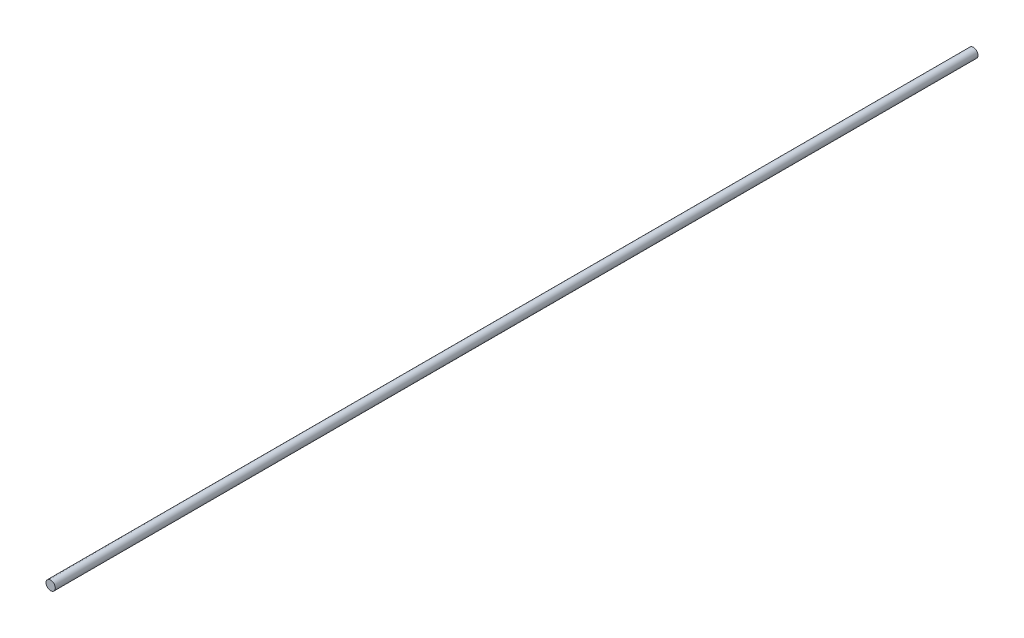
ISO-10303-21;
HEADER;
FILE_DESCRIPTION(('STEP AP214'),'2;1');
FILE_NAME('part.step','',(''),(''),'','','');
FILE_SCHEMA(('AUTOMOTIVE_DESIGN { 1 0 10303 214 1 1 1 1 }'));
ENDSEC;
DATA;
#1=APPLICATION_CONTEXT('core data for automotive mechanical design processes');
#2=APPLICATION_PROTOCOL_DEFINITION('international standard','automotive_design',2000,#1);
#3=PRODUCT_CONTEXT('',#1,'mechanical');
#4=PRODUCT('Part','Part','',(#3));
#5=PRODUCT_RELATED_PRODUCT_CATEGORY('part','',(#4));
#6=PRODUCT_DEFINITION_FORMATION('','',#4);
#7=PRODUCT_DEFINITION_CONTEXT('part definition',#1,'design');
#8=PRODUCT_DEFINITION('design','',#6,#7);
#9=PRODUCT_DEFINITION_SHAPE('','',#8);
#10=(LENGTH_UNIT() NAMED_UNIT(*) SI_UNIT(.MILLI.,.METRE.));
#11=(NAMED_UNIT(*) PLANE_ANGLE_UNIT() SI_UNIT($,.RADIAN.));
#12=(NAMED_UNIT(*) SI_UNIT($,.STERADIAN.) SOLID_ANGLE_UNIT());
#13=UNCERTAINTY_MEASURE_WITH_UNIT(LENGTH_MEASURE(1.E-05),#10,'distance_accuracy_value','');
#14=(GEOMETRIC_REPRESENTATION_CONTEXT(3) GLOBAL_UNCERTAINTY_ASSIGNED_CONTEXT((#13)) GLOBAL_UNIT_ASSIGNED_CONTEXT((#10,
#11,#12)) REPRESENTATION_CONTEXT('',''));
#15=CARTESIAN_POINT('',(0.,0.,0.));
#16=DIRECTION('',(0.,0.,1.));
#17=DIRECTION('',(1.,0.,0.));
#18=AXIS2_PLACEMENT_3D('',#15,#16,#17);
#19=CARTESIAN_POINT('',(0.,0.,315.468));
#20=DIRECTION('',(0.,0.,-1.));
#21=DIRECTION('',(-1.,0.,0.));
#22=AXIS2_PLACEMENT_3D('',#19,#20,#21);
#23=CYLINDRICAL_SURFACE('',#22,1.5875);
#24=CARTESIAN_POINT('',(0.,0.,315.468));
#25=DIRECTION('',(0.,0.,1.));
#26=DIRECTION('',(1.,0.,0.));
#27=AXIS2_PLACEMENT_3D('',#24,#25,#26);
#28=CIRCLE('',#27,1.5875);
#29=CARTESIAN_POINT('',(1.5875,0.,315.468));
#30=VERTEX_POINT('',#29);
#31=EDGE_CURVE('E10',#30,#30,#28,.T.);
#32=ORIENTED_EDGE('',*,*,#31,.F.);
#33=EDGE_LOOP('',(#32));
#34=FACE_BOUND('',#33,.T.);
#35=CARTESIAN_POINT('',(0.,0.,0.));
#36=DIRECTION('',(0.,0.,1.));
#37=DIRECTION('',(1.,0.,0.));
#38=AXIS2_PLACEMENT_3D('',#35,#36,#37);
#39=CIRCLE('',#38,1.5875);
#40=CARTESIAN_POINT('',(1.5875,0.,0.));
#41=VERTEX_POINT('',#40);
#42=EDGE_CURVE('E46',#41,#41,#39,.T.);
#43=ORIENTED_EDGE('',*,*,#42,.T.);
#44=EDGE_LOOP('',(#43));
#45=FACE_BOUND('',#44,.T.);
#46=ADVANCED_FACE('F43',(#34,#45),#23,.T.);
#47=CARTESIAN_POINT('',(0.,0.,315.468));
#48=DIRECTION('',(0.,0.,1.));
#49=DIRECTION('',(1.,0.,0.));
#50=AXIS2_PLACEMENT_3D('',#47,#48,#49);
#51=PLANE('',#50);
#52=ORIENTED_EDGE('',*,*,#31,.T.);
#53=EDGE_LOOP('',(#52));
#54=FACE_BOUND('',#53,.T.);
#55=ADVANCED_FACE('F60',(#54),#51,.T.);
#56=CARTESIAN_POINT('',(0.,0.,0.));
#57=DIRECTION('',(0.,0.,1.));
#58=DIRECTION('',(1.,0.,0.));
#59=AXIS2_PLACEMENT_3D('',#56,#57,#58);
#60=PLANE('',#59);
#61=ORIENTED_EDGE('',*,*,#42,.F.);
#62=EDGE_LOOP('',(#61));
#63=FACE_BOUND('',#62,.T.);
#64=ADVANCED_FACE('F58',(#63),#60,.F.);
#65=CLOSED_SHELL('',(#46,#55,#64));
#66=MANIFOLD_SOLID_BREP('B2',#65);
#67=ADVANCED_BREP_SHAPE_REPRESENTATION('',(#18,#66),#14);
#68=SHAPE_DEFINITION_REPRESENTATION(#9,#67);
ENDSEC;
END-ISO-10303-21;
